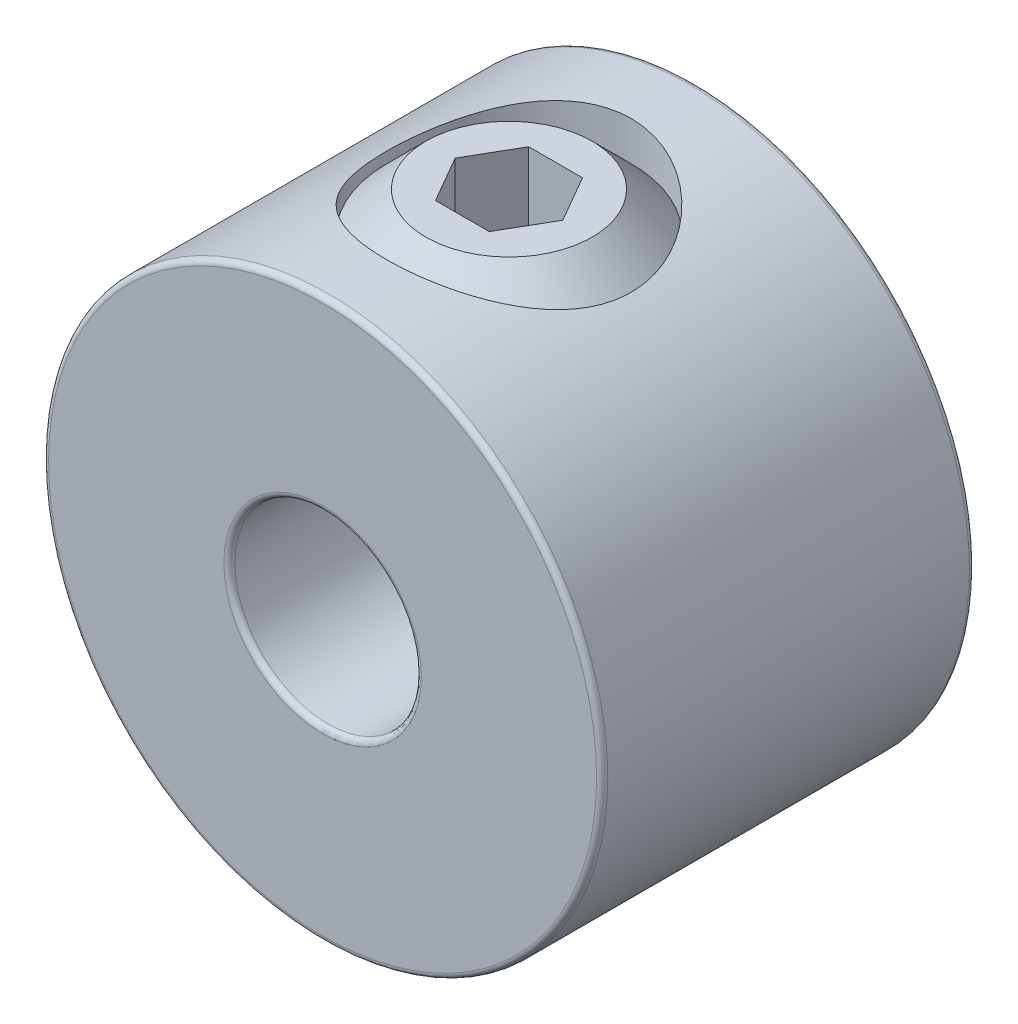
ISO-10303-21;
HEADER;
FILE_DESCRIPTION(('STEP AP214'),'2;1');
FILE_NAME('part.step','',(''),(''),'','','');
FILE_SCHEMA(('AUTOMOTIVE_DESIGN { 1 0 10303 214 1 1 1 1 }'));
ENDSEC;
DATA;
#1=APPLICATION_CONTEXT('core data for automotive mechanical design processes');
#2=APPLICATION_PROTOCOL_DEFINITION('international standard','automotive_design',2000,#1);
#3=PRODUCT_CONTEXT('',#1,'mechanical');
#4=PRODUCT('Part','Part','',(#3));
#5=PRODUCT_RELATED_PRODUCT_CATEGORY('part','',(#4));
#6=PRODUCT_DEFINITION_FORMATION('','',#4);
#7=PRODUCT_DEFINITION_CONTEXT('part definition',#1,'design');
#8=PRODUCT_DEFINITION('design','',#6,#7);
#9=PRODUCT_DEFINITION_SHAPE('','',#8);
#10=(LENGTH_UNIT() NAMED_UNIT(*) SI_UNIT(.MILLI.,.METRE.));
#11=(NAMED_UNIT(*) PLANE_ANGLE_UNIT() SI_UNIT($,.RADIAN.));
#12=(NAMED_UNIT(*) SI_UNIT($,.STERADIAN.) SOLID_ANGLE_UNIT());
#13=UNCERTAINTY_MEASURE_WITH_UNIT(LENGTH_MEASURE(1.E-05),#10,'distance_accuracy_value','');
#14=(GEOMETRIC_REPRESENTATION_CONTEXT(3) GLOBAL_UNCERTAINTY_ASSIGNED_CONTEXT((#13)) GLOBAL_UNIT_ASSIGNED_CONTEXT((#10,
#11,#12)) REPRESENTATION_CONTEXT('',''));
#15=CARTESIAN_POINT('',(0.,0.,0.));
#16=DIRECTION('',(0.,0.,1.));
#17=DIRECTION('',(1.,0.,0.));
#18=AXIS2_PLACEMENT_3D('',#15,#16,#17);
#19=CARTESIAN_POINT('',(0.,4.7625,0.));
#20=DIRECTION('',(0.,1.,0.));
#21=DIRECTION('',(-1.,0.,0.));
#22=AXIS2_PLACEMENT_3D('',#19,#20,#21);
#23=PLANE('',#22);
#24=CARTESIAN_POINT('',(0.,4.7625,0.));
#25=DIRECTION('',(0.,1.,0.));
#26=DIRECTION('',(-1.,0.,0.));
#27=AXIS2_PLACEMENT_3D('',#24,#25,#26);
#28=CIRCLE('',#27,1.41636774419345);
#29=CARTESIAN_POINT('',(-1.41636774419345,4.7625,0.));
#30=VERTEX_POINT('',#29);
#31=EDGE_CURVE('E12',#30,#30,#28,.T.);
#32=ORIENTED_EDGE('',*,*,#31,.T.);
#33=EDGE_LOOP('',(#32));
#34=FACE_BOUND('',#33,.T.);
#35=DIRECTION('',(1.,0.,0.));
#36=VECTOR('',#35,1.);
#37=CARTESIAN_POINT('',(-0.458271776169267,4.76249999999999,-0.793749999999997));
#38=LINE('',#37,#36);
#39=CARTESIAN_POINT('',(-0.458271776169267,4.76249999999999,-0.793749999999997));
#40=VERTEX_POINT('',#39);
#41=CARTESIAN_POINT('',(0.458271776169265,4.7625,-0.793749999999997));
#42=VERTEX_POINT('',#41);
#43=EDGE_CURVE('E115',#40,#42,#38,.T.);
#44=ORIENTED_EDGE('',*,*,#43,.T.);
#45=DIRECTION('',(0.5,0.,0.866025403784439));
#46=VECTOR('',#45,1.);
#47=CARTESIAN_POINT('',(0.458271776169265,4.76249999999999,-0.793749999999997));
#48=LINE('',#47,#46);
#49=CARTESIAN_POINT('',(0.91654355233853,4.76249999999999,0.));
#50=VERTEX_POINT('',#49);
#51=EDGE_CURVE('E61',#42,#50,#48,.T.);
#52=ORIENTED_EDGE('',*,*,#51,.T.);
#53=DIRECTION('',(-0.5,0.,0.866025403784439));
#54=VECTOR('',#53,1.);
#55=CARTESIAN_POINT('',(0.91654355233853,4.76249999999999,0.));
#56=LINE('',#55,#54);
#57=CARTESIAN_POINT('',(0.458271776169265,4.76249999999999,0.793750000000003));
#58=VERTEX_POINT('',#57);
#59=EDGE_CURVE('E119',#50,#58,#56,.T.);
#60=ORIENTED_EDGE('',*,*,#59,.T.);
#61=DIRECTION('',(-1.,0.,0.));
#62=VECTOR('',#61,1.);
#63=CARTESIAN_POINT('',(0.458271776169265,4.76249999999999,0.793750000000003));
#64=LINE('',#63,#62);
#65=CARTESIAN_POINT('',(-0.458271776169266,4.76249999999999,0.793750000000002));
#66=VERTEX_POINT('',#65);
#67=EDGE_CURVE('E182',#58,#66,#64,.T.);
#68=ORIENTED_EDGE('',*,*,#67,.T.);
#69=DIRECTION('',(-0.5,0.,-0.866025403784438));
#70=VECTOR('',#69,1.);
#71=CARTESIAN_POINT('',(-0.458271776169266,4.76249999999999,0.793750000000002));
#72=LINE('',#71,#70);
#73=CARTESIAN_POINT('',(-0.916543552338532,4.76249999999999,0.));
#74=VERTEX_POINT('',#73);
#75=EDGE_CURVE('E167',#66,#74,#72,.T.);
#76=ORIENTED_EDGE('',*,*,#75,.T.);
#77=DIRECTION('',(0.5,0.,-0.866025403784439));
#78=VECTOR('',#77,1.);
#79=CARTESIAN_POINT('',(-0.916543552338532,4.76249999999999,0.));
#80=LINE('',#79,#78);
#81=EDGE_CURVE('E163',#74,#40,#80,.T.);
#82=ORIENTED_EDGE('',*,*,#81,.T.);
#83=EDGE_LOOP('',(#44,#52,#60,#68,#76,#82));
#84=FACE_BOUND('',#83,.T.);
#85=ADVANCED_FACE('F47',(#34,#84),#23,.T.);
#86=CARTESIAN_POINT('',(0.,4.7625,0.));
#87=DIRECTION('',(0.,-1.,0.));
#88=DIRECTION('',(1.,0.,0.));
#89=AXIS2_PLACEMENT_3D('',#86,#87,#88);
#90=CONICAL_SURFACE('',#89,1.41636774419345,0.785398163397449);
#91=CARTESIAN_POINT('',(0.,4.09606774419345,0.));
#92=DIRECTION('',(0.,1.,0.));
#93=DIRECTION('',(-1.,0.,0.));
#94=AXIS2_PLACEMENT_3D('',#91,#92,#93);
#95=CIRCLE('',#94,2.0828);
#96=CARTESIAN_POINT('',(-2.0828,4.09606774419345,0.));
#97=VERTEX_POINT('',#96);
#98=EDGE_CURVE('E54',#97,#97,#95,.T.);
#99=ORIENTED_EDGE('',*,*,#98,.T.);
#100=EDGE_LOOP('',(#99));
#101=FACE_BOUND('',#100,.T.);
#102=ORIENTED_EDGE('',*,*,#31,.F.);
#103=EDGE_LOOP('',(#102));
#104=FACE_BOUND('',#103,.T.);
#105=ADVANCED_FACE('F137',(#101,#104),#90,.T.);
#106=CARTESIAN_POINT('',(0.,1.5875,0.));
#107=DIRECTION('',(0.,1.,0.));
#108=DIRECTION('',(-1.,0.,0.));
#109=AXIS2_PLACEMENT_3D('',#106,#107,#108);
#110=CYLINDRICAL_SURFACE('',#109,2.0828);
#111=CARTESIAN_POINT('',(0.,2.25393225580655,0.));
#112=DIRECTION('',(0.,1.,0.));
#113=DIRECTION('',(-1.,0.,0.));
#114=AXIS2_PLACEMENT_3D('',#111,#112,#113);
#115=CIRCLE('',#114,2.0828);
#116=CARTESIAN_POINT('',(-2.0828,2.25393225580655,0.));
#117=VERTEX_POINT('',#116);
#118=EDGE_CURVE('E132',#117,#117,#115,.T.);
#119=ORIENTED_EDGE('',*,*,#118,.T.);
#120=EDGE_LOOP('',(#119));
#121=FACE_BOUND('',#120,.T.);
#122=ORIENTED_EDGE('',*,*,#98,.F.);
#123=EDGE_LOOP('',(#122));
#124=FACE_BOUND('',#123,.T.);
#125=ADVANCED_FACE('F140',(#121,#124),#110,.T.);
#126=CARTESIAN_POINT('',(0.,2.25393225580655,0.));
#127=DIRECTION('',(0.,1.,0.));
#128=DIRECTION('',(-1.,0.,0.));
#129=AXIS2_PLACEMENT_3D('',#126,#127,#128);
#130=CONICAL_SURFACE('',#129,2.0828,0.785398163397448);
#131=CARTESIAN_POINT('',(0.,1.5875,0.));
#132=DIRECTION('',(0.,1.,0.));
#133=DIRECTION('',(-1.,0.,0.));
#134=AXIS2_PLACEMENT_3D('',#131,#132,#133);
#135=CIRCLE('',#134,1.41636774419345);
#136=CARTESIAN_POINT('',(-1.41636774419345,1.5875,0.));
#137=VERTEX_POINT('',#136);
#138=EDGE_CURVE('E124',#137,#137,#135,.T.);
#139=ORIENTED_EDGE('',*,*,#138,.T.);
#140=EDGE_LOOP('',(#139));
#141=FACE_BOUND('',#140,.T.);
#142=ORIENTED_EDGE('',*,*,#118,.F.);
#143=EDGE_LOOP('',(#142));
#144=FACE_BOUND('',#143,.T.);
#145=ADVANCED_FACE('F142',(#141,#144),#130,.T.);
#146=CARTESIAN_POINT('',(-1.41636774419345,1.5875,0.));
#147=DIRECTION('',(0.,-1.,0.));
#148=DIRECTION('',(1.,0.,0.));
#149=AXIS2_PLACEMENT_3D('',#146,#147,#148);
#150=PLANE('',#149);
#151=CARTESIAN_POINT('',(0.,1.5875,0.));
#152=DIRECTION('',(0.,1.,0.));
#153=DIRECTION('',(-1.,0.,0.));
#154=AXIS2_PLACEMENT_3D('',#151,#152,#153);
#155=CIRCLE('',#154,0.799718706967865);
#156=CARTESIAN_POINT('',(-0.799718706967865,1.5875,0.));
#157=VERTEX_POINT('',#156);
#158=EDGE_CURVE('E120',#157,#157,#155,.T.);
#159=ORIENTED_EDGE('',*,*,#158,.T.);
#160=EDGE_LOOP('',(#159));
#161=FACE_BOUND('',#160,.T.);
#162=ORIENTED_EDGE('',*,*,#138,.F.);
#163=EDGE_LOOP('',(#162));
#164=FACE_BOUND('',#163,.T.);
#165=ADVANCED_FACE('F149',(#161,#164),#150,.T.);
#166=CARTESIAN_POINT('',(0.,1.5875,0.));
#167=DIRECTION('',(0.,-1.,0.));
#168=DIRECTION('',(1.,0.,0.));
#169=AXIS2_PLACEMENT_3D('',#166,#167,#168);
#170=CONICAL_SURFACE('',#169,0.799718706967865,0.785398163397448);
#171=CARTESIAN_POINT('',(0.,2.38721870696786,0.));
#172=VERTEX_POINT('',#171);
#173=VERTEX_LOOP('',#172);
#174=FACE_BOUND('',#173,.T.);
#175=ORIENTED_EDGE('',*,*,#158,.F.);
#176=EDGE_LOOP('',(#175));
#177=FACE_BOUND('',#176,.T.);
#178=ADVANCED_FACE('F216',(#174,#177),#170,.F.);
#179=CARTESIAN_POINT('',(0.458271776169265,3.17499999999999,-0.793749999999997));
#180=DIRECTION('',(-0.866025403784439,0.,0.5));
#181=DIRECTION('',(0.5,0.,0.866025403784439));
#182=AXIS2_PLACEMENT_3D('',#179,#180,#181);
#183=PLANE('',#182);
#184=ORIENTED_EDGE('',*,*,#51,.F.);
#185=DIRECTION('',(0.,1.,0.));
#186=VECTOR('',#185,1.);
#187=CARTESIAN_POINT('',(0.458271776169265,3.17499999999999,-0.793749999999997));
#188=LINE('',#187,#186);
#189=CARTESIAN_POINT('',(0.458271776169265,3.17499999999999,-0.793749999999997));
#190=VERTEX_POINT('',#189);
#191=EDGE_CURVE('E114',#190,#42,#188,.T.);
#192=ORIENTED_EDGE('',*,*,#191,.F.);
#193=DIRECTION('',(0.5,0.,0.866025403784439));
#194=VECTOR('',#193,1.);
#195=CARTESIAN_POINT('',(0.458271776169265,3.17499999999999,-0.793749999999997));
#196=LINE('',#195,#194);
#197=CARTESIAN_POINT('',(0.91654355233853,3.17499999999999,0.));
#198=VERTEX_POINT('',#197);
#199=EDGE_CURVE('E105',#190,#198,#196,.T.);
#200=ORIENTED_EDGE('',*,*,#199,.T.);
#201=DIRECTION('',(0.,1.,0.));
#202=VECTOR('',#201,1.);
#203=CARTESIAN_POINT('',(0.91654355233853,3.17499999999999,0.));
#204=LINE('',#203,#202);
#205=EDGE_CURVE('E113',#198,#50,#204,.T.);
#206=ORIENTED_EDGE('',*,*,#205,.T.);
#207=EDGE_LOOP('',(#184,#192,#200,#206));
#208=FACE_BOUND('',#207,.T.);
#209=ADVANCED_FACE('F112',(#208),#183,.T.);
#210=CARTESIAN_POINT('',(0.91654355233853,3.17499999999999,0.));
#211=DIRECTION('',(-0.866025403784439,0.,-0.5));
#212=DIRECTION('',(-0.5,0.,0.866025403784439));
#213=AXIS2_PLACEMENT_3D('',#210,#211,#212);
#214=PLANE('',#213);
#215=ORIENTED_EDGE('',*,*,#59,.F.);
#216=ORIENTED_EDGE('',*,*,#205,.F.);
#217=DIRECTION('',(-0.5,0.,0.866025403784439));
#218=VECTOR('',#217,1.);
#219=CARTESIAN_POINT('',(0.91654355233853,3.17499999999999,0.));
#220=LINE('',#219,#218);
#221=CARTESIAN_POINT('',(0.458271776169265,3.17499999999999,0.793750000000003));
#222=VERTEX_POINT('',#221);
#223=EDGE_CURVE('E101',#198,#222,#220,.T.);
#224=ORIENTED_EDGE('',*,*,#223,.T.);
#225=DIRECTION('',(0.,1.,0.));
#226=VECTOR('',#225,1.);
#227=CARTESIAN_POINT('',(0.458271776169265,3.17499999999999,0.793750000000003));
#228=LINE('',#227,#226);
#229=EDGE_CURVE('E121',#222,#58,#228,.T.);
#230=ORIENTED_EDGE('',*,*,#229,.T.);
#231=EDGE_LOOP('',(#215,#216,#224,#230));
#232=FACE_BOUND('',#231,.T.);
#233=ADVANCED_FACE('F117',(#232),#214,.T.);
#234=CARTESIAN_POINT('',(0.458271776169265,3.17499999999999,0.793750000000003));
#235=DIRECTION('',(0.,0.,-1.));
#236=DIRECTION('',(-1.,0.,0.));
#237=AXIS2_PLACEMENT_3D('',#234,#235,#236);
#238=PLANE('',#237);
#239=ORIENTED_EDGE('',*,*,#67,.F.);
#240=ORIENTED_EDGE('',*,*,#229,.F.);
#241=DIRECTION('',(-1.,0.,0.));
#242=VECTOR('',#241,1.);
#243=CARTESIAN_POINT('',(0.458271776169265,3.17499999999999,0.793750000000003));
#244=LINE('',#243,#242);
#245=CARTESIAN_POINT('',(-0.458271776169266,3.17499999999999,0.793750000000002));
#246=VERTEX_POINT('',#245);
#247=EDGE_CURVE('E107',#222,#246,#244,.T.);
#248=ORIENTED_EDGE('',*,*,#247,.T.);
#249=DIRECTION('',(0.,1.,0.));
#250=VECTOR('',#249,1.);
#251=CARTESIAN_POINT('',(-0.458271776169266,3.17499999999999,0.793750000000002));
#252=LINE('',#251,#250);
#253=EDGE_CURVE('E126',#246,#66,#252,.T.);
#254=ORIENTED_EDGE('',*,*,#253,.T.);
#255=EDGE_LOOP('',(#239,#240,#248,#254));
#256=FACE_BOUND('',#255,.T.);
#257=ADVANCED_FACE('F180',(#256),#238,.T.);
#258=CARTESIAN_POINT('',(-0.458271776169266,3.17499999999999,0.793750000000002));
#259=DIRECTION('',(0.866025403784438,0.,-0.5));
#260=DIRECTION('',(-0.5,0.,-0.866025403784439));
#261=AXIS2_PLACEMENT_3D('',#258,#259,#260);
#262=PLANE('',#261);
#263=ORIENTED_EDGE('',*,*,#75,.F.);
#264=ORIENTED_EDGE('',*,*,#253,.F.);
#265=DIRECTION('',(-0.5,0.,-0.866025403784438));
#266=VECTOR('',#265,1.);
#267=CARTESIAN_POINT('',(-0.458271776169266,3.17499999999999,0.793750000000002));
#268=LINE('',#267,#266);
#269=CARTESIAN_POINT('',(-0.916543552338532,3.17499999999999,0.));
#270=VERTEX_POINT('',#269);
#271=EDGE_CURVE('E193',#246,#270,#268,.T.);
#272=ORIENTED_EDGE('',*,*,#271,.T.);
#273=DIRECTION('',(0.,1.,0.));
#274=VECTOR('',#273,1.);
#275=CARTESIAN_POINT('',(-0.916543552338532,3.17499999999999,0.));
#276=LINE('',#275,#274);
#277=EDGE_CURVE('E175',#270,#74,#276,.T.);
#278=ORIENTED_EDGE('',*,*,#277,.T.);
#279=EDGE_LOOP('',(#263,#264,#272,#278));
#280=FACE_BOUND('',#279,.T.);
#281=ADVANCED_FACE('F184',(#280),#262,.T.);
#282=CARTESIAN_POINT('',(-0.916543552338532,3.17499999999999,0.));
#283=DIRECTION('',(0.866025403784439,0.,0.5));
#284=DIRECTION('',(0.5,0.,-0.866025403784439));
#285=AXIS2_PLACEMENT_3D('',#282,#283,#284);
#286=PLANE('',#285);
#287=ORIENTED_EDGE('',*,*,#81,.F.);
#288=ORIENTED_EDGE('',*,*,#277,.F.);
#289=DIRECTION('',(0.5,0.,-0.866025403784439));
#290=VECTOR('',#289,1.);
#291=CARTESIAN_POINT('',(-0.916543552338532,3.17499999999999,0.));
#292=LINE('',#291,#290);
#293=CARTESIAN_POINT('',(-0.458271776169267,3.17499999999999,-0.793749999999997));
#294=VERTEX_POINT('',#293);
#295=EDGE_CURVE('E191',#270,#294,#292,.T.);
#296=ORIENTED_EDGE('',*,*,#295,.T.);
#297=DIRECTION('',(0.,1.,0.));
#298=VECTOR('',#297,1.);
#299=CARTESIAN_POINT('',(-0.458271776169267,3.17499999999999,-0.793749999999997));
#300=LINE('',#299,#298);
#301=EDGE_CURVE('E172',#294,#40,#300,.T.);
#302=ORIENTED_EDGE('',*,*,#301,.T.);
#303=EDGE_LOOP('',(#287,#288,#296,#302));
#304=FACE_BOUND('',#303,.T.);
#305=ADVANCED_FACE('F197',(#304),#286,.T.);
#306=CARTESIAN_POINT('',(-0.458271776169267,3.17499999999999,-0.793749999999997));
#307=DIRECTION('',(0.,0.,1.));
#308=DIRECTION('',(1.,0.,0.));
#309=AXIS2_PLACEMENT_3D('',#306,#307,#308);
#310=PLANE('',#309);
#311=ORIENTED_EDGE('',*,*,#43,.F.);
#312=ORIENTED_EDGE('',*,*,#301,.F.);
#313=DIRECTION('',(1.,0.,0.));
#314=VECTOR('',#313,1.);
#315=CARTESIAN_POINT('',(-0.458271776169267,3.17499999999999,-0.793749999999997));
#316=LINE('',#315,#314);
#317=EDGE_CURVE('E173',#294,#190,#316,.T.);
#318=ORIENTED_EDGE('',*,*,#317,.T.);
#319=ORIENTED_EDGE('',*,*,#191,.T.);
#320=EDGE_LOOP('',(#311,#312,#318,#319));
#321=FACE_BOUND('',#320,.T.);
#322=ADVANCED_FACE('F198',(#321),#310,.T.);
#323=CARTESIAN_POINT('',(0.,3.17499999999999,-1.5875));
#324=DIRECTION('',(0.,1.,0.));
#325=DIRECTION('',(0.,0.,1.));
#326=AXIS2_PLACEMENT_3D('',#323,#324,#325);
#327=PLANE('',#326);
#328=ORIENTED_EDGE('',*,*,#199,.F.);
#329=ORIENTED_EDGE('',*,*,#317,.F.);
#330=ORIENTED_EDGE('',*,*,#295,.F.);
#331=ORIENTED_EDGE('',*,*,#271,.F.);
#332=ORIENTED_EDGE('',*,*,#247,.F.);
#333=ORIENTED_EDGE('',*,*,#223,.F.);
#334=EDGE_LOOP('',(#328,#329,#330,#331,#332,#333));
#335=FACE_BOUND('',#334,.T.);
#336=ADVANCED_FACE('F103',(#335),#327,.T.);
#337=CLOSED_SHELL('',(#85,#105,#125,#145,#165,#178,#209,#233,#257,#281,#305,#322,#336));
#338=MANIFOLD_SOLID_BREP('B2',#337);
#339=CARTESIAN_POINT('',(0.,0.,3.175));
#340=DIRECTION('',(0.,0.,1.));
#341=DIRECTION('',(1.,0.,0.));
#342=AXIS2_PLACEMENT_3D('',#339,#340,#341);
#343=PLANE('',#342);
#344=CARTESIAN_POINT('',(0.,0.,3.175));
#345=DIRECTION('',(0.,0.,1.));
#346=DIRECTION('',(1.,0.,0.));
#347=AXIS2_PLACEMENT_3D('',#344,#345,#346);
#348=CIRCLE('',#347,1.68275);
#349=CARTESIAN_POINT('',(1.68275,0.,3.175));
#350=VERTEX_POINT('',#349);
#351=EDGE_CURVE('E404',#350,#350,#348,.F.);
#352=ORIENTED_EDGE('',*,*,#351,.T.);
#353=EDGE_LOOP('',(#352));
#354=FACE_BOUND('',#353,.T.);
#355=CARTESIAN_POINT('',(0.,0.,3.175));
#356=DIRECTION('',(0.,0.,1.));
#357=DIRECTION('',(1.,0.,0.));
#358=AXIS2_PLACEMENT_3D('',#355,#356,#357);
#359=CIRCLE('',#358,4.66725);
#360=CARTESIAN_POINT('',(4.66725,0.,3.175));
#361=VERTEX_POINT('',#360);
#362=EDGE_CURVE('E407',#361,#361,#359,.T.);
#363=ORIENTED_EDGE('',*,*,#362,.T.);
#364=EDGE_LOOP('',(#363));
#365=FACE_BOUND('',#364,.T.);
#366=ADVANCED_FACE('F302',(#354,#365),#343,.T.);
#367=CARTESIAN_POINT('',(0.,0.,-3.175));
#368=DIRECTION('',(0.,0.,1.));
#369=DIRECTION('',(1.,0.,0.));
#370=AXIS2_PLACEMENT_3D('',#367,#368,#369);
#371=PLANE('',#370);
#372=CARTESIAN_POINT('',(0.,0.,-3.175));
#373=DIRECTION('',(0.,0.,1.));
#374=DIRECTION('',(1.,0.,0.));
#375=AXIS2_PLACEMENT_3D('',#372,#373,#374);
#376=CIRCLE('',#375,1.68275);
#377=CARTESIAN_POINT('',(1.68275,0.,-3.175));
#378=VERTEX_POINT('',#377);
#379=EDGE_CURVE('E423',#378,#378,#376,.T.);
#380=ORIENTED_EDGE('',*,*,#379,.T.);
#381=EDGE_LOOP('',(#380));
#382=FACE_BOUND('',#381,.T.);
#383=CARTESIAN_POINT('',(0.,0.,-3.175));
#384=DIRECTION('',(0.,0.,1.));
#385=DIRECTION('',(1.,0.,0.));
#386=AXIS2_PLACEMENT_3D('',#383,#384,#385);
#387=CIRCLE('',#386,4.66725);
#388=CARTESIAN_POINT('',(4.66725,0.,-3.175));
#389=VERTEX_POINT('',#388);
#390=EDGE_CURVE('E426',#389,#389,#387,.F.);
#391=ORIENTED_EDGE('',*,*,#390,.T.);
#392=EDGE_LOOP('',(#391));
#393=FACE_BOUND('',#392,.T.);
#394=ADVANCED_FACE('F377',(#382,#393),#371,.F.);
#395=CARTESIAN_POINT('',(0.,0.,3.175));
#396=DIRECTION('',(0.,0.,-1.));
#397=DIRECTION('',(-1.,0.,0.));
#398=AXIS2_PLACEMENT_3D('',#395,#396,#397);
#399=CYLINDRICAL_SURFACE('',#398,4.7625);
#400=CARTESIAN_POINT('',(0.,0.,-3.07975));
#401=DIRECTION('',(0.,0.,1.));
#402=DIRECTION('',(1.,0.,0.));
#403=AXIS2_PLACEMENT_3D('',#400,#401,#402);
#404=CIRCLE('',#403,4.7625);
#405=CARTESIAN_POINT('',(4.7625,0.,-3.07975));
#406=VERTEX_POINT('',#405);
#407=EDGE_CURVE('E45',#406,#406,#404,.T.);
#408=ORIENTED_EDGE('',*,*,#407,.T.);
#409=EDGE_LOOP('',(#408));
#410=FACE_BOUND('',#409,.T.);
#411=CARTESIAN_POINT('',(0.,0.,3.07975));
#412=DIRECTION('',(0.,0.,1.));
#413=DIRECTION('',(1.,0.,0.));
#414=AXIS2_PLACEMENT_3D('',#411,#412,#413);
#415=CIRCLE('',#414,4.7625);
#416=CARTESIAN_POINT('',(4.7625,0.,3.07975));
#417=VERTEX_POINT('',#416);
#418=EDGE_CURVE('E310',#417,#417,#415,.F.);
#419=ORIENTED_EDGE('',*,*,#418,.T.);
#420=EDGE_LOOP('',(#419));
#421=FACE_BOUND('',#420,.T.);
#422=CARTESIAN_POINT('',(0.,4.7625,-2.0828));
#423=CARTESIAN_POINT('',(0.111071743653542,4.76249603683798,-2.08279511454019));
#424=CARTESIAN_POINT('',(0.222321981209684,4.75857075047714,-2.07386284884724));
#425=CARTESIAN_POINT('',(0.44163204752813,4.74326014196689,-2.03848302953371));
#426=CARTESIAN_POINT('',(0.549683347848137,4.73185647835827,-2.01199241060061));
#427=CARTESIAN_POINT('',(0.759075641824642,4.7028017052965,-1.94267235968527));
#428=CARTESIAN_POINT('',(0.860438815402187,4.68517262017172,-1.89990048656392));
#429=CARTESIAN_POINT('',(1.05444297980025,4.64536073563245,-1.79948474143014));
#430=CARTESIAN_POINT('',(1.14708611927771,4.6231790623039,-1.74184454620408));
#431=CARTESIAN_POINT('',(1.32619574297911,4.57511002512907,-1.61003985545174));
#432=CARTESIAN_POINT('',(1.41212894971673,4.54909352773982,-1.53519826357987));
#433=CARTESIAN_POINT('',(1.57069122617801,4.49681211039082,-1.37255123891813));
#434=CARTESIAN_POINT('',(1.64331261413432,4.47054705613312,-1.28473837332359));
#435=CARTESIAN_POINT('',(1.77718548713285,4.41910049192964,-1.0927508917876));
#436=CARTESIAN_POINT('',(1.83758288413799,4.39405989123975,-0.987938900088163));
#437=CARTESIAN_POINT('',(1.93965267630104,4.34997330262519,-0.76839674653208));
#438=CARTESIAN_POINT('',(1.98133567235285,4.33092392277086,-0.653672243714194));
#439=CARTESIAN_POINT('',(2.04253551397779,4.30238873246805,-0.423696863051076));
#440=CARTESIAN_POINT('',(2.06308358312361,4.29246082811126,-0.308777523916066));
#441=CARTESIAN_POINT('',(2.08463987832703,4.28203712029549,-0.0767266547426842));
#442=CARTESIAN_POINT('',(2.08566052842421,4.2815353196173,0.040403421252241));
#443=CARTESIAN_POINT('',(2.06890402974151,4.28965031049058,0.262769847892723));
#444=CARTESIAN_POINT('',(2.05273752581227,4.29748584669176,0.368162062558629));
#445=CARTESIAN_POINT('',(2.00478801183591,4.32006087723989,0.574552036914508));
#446=CARTESIAN_POINT('',(1.97300163554703,4.33480185974894,0.675548844239808));
#447=CARTESIAN_POINT('',(1.89408562418665,4.36986708620376,0.87295534667494));
#448=CARTESIAN_POINT('',(1.84663122587168,4.39030794585783,0.969213557296075));
#449=CARTESIAN_POINT('',(1.73795862832961,4.43444930703374,1.15279938929592));
#450=CARTESIAN_POINT('',(1.67673471928593,4.458151159207,1.24012328395491));
#451=CARTESIAN_POINT('',(1.5355152991307,4.50885047006117,1.41200269581225));
#452=CARTESIAN_POINT('',(1.45429620676035,4.53594828217284,1.49552632521228));
#453=CARTESIAN_POINT('',(1.27876496657885,4.58852439419557,1.64813395927907));
#454=CARTESIAN_POINT('',(1.18444911674085,4.61400223321385,1.71721386729299));
#455=CARTESIAN_POINT('',(0.98199315473799,4.66135005528445,1.84070142328266));
#456=CARTESIAN_POINT('',(0.873541867649991,4.68310019510073,1.89464833067304));
#457=CARTESIAN_POINT('',(0.647907883462879,4.71960237914975,1.98316213937343));
#458=CARTESIAN_POINT('',(0.530730563553071,4.73435869252319,2.01774086567294));
#459=CARTESIAN_POINT('',(0.29955813000625,4.75438789864071,2.06428227255898));
#460=CARTESIAN_POINT('',(0.185891496759438,4.76023920962634,2.07762721422875));
#461=CARTESIAN_POINT('',(-0.0422002334821483,4.76367688780338,2.08549375299993));
#462=CARTESIAN_POINT('',(-0.156625071558397,4.76126594457006,2.0800214755859));
#463=CARTESIAN_POINT('',(-0.376239500843618,4.74881910942428,2.05136058889142));
#464=CARTESIAN_POINT('',(-0.481587950692455,4.73921662092109,2.02917857508186));
#465=CARTESIAN_POINT('',(-0.686930546466433,4.71383524207829,1.96916956922145));
#466=CARTESIAN_POINT('',(-0.786924032776088,4.69805559282654,1.93134065479507));
#467=CARTESIAN_POINT('',(-0.982261063048847,4.66119752506809,1.83989504938421));
#468=CARTESIAN_POINT('',(-1.07736167728556,4.63996894204687,1.78582197069));
#469=CARTESIAN_POINT('',(-1.25748262320955,4.59443017780039,1.6639208402943));
#470=CARTESIAN_POINT('',(-1.34249857280958,4.57011866637559,1.59608684350934));
#471=CARTESIAN_POINT('',(-1.50704626884199,4.51865251251798,1.44239782605641));
#472=CARTESIAN_POINT('',(-1.58562810518119,4.4914242669029,1.35554792805158));
#473=CARTESIAN_POINT('',(-1.72740709734185,4.43882896395537,1.16953050819299));
#474=CARTESIAN_POINT('',(-1.7905993443691,4.41346250227109,1.07035907134913));
#475=CARTESIAN_POINT('',(-1.90090710616626,4.36710736891284,0.859669195288205));
#476=CARTESIAN_POINT('',(-1.94765867230782,4.34622137271274,0.747935873022526));
#477=CARTESIAN_POINT('',(-2.0212491556326,4.31249652288353,0.516972846718103));
#478=CARTESIAN_POINT('',(-2.04810675798185,4.29965011992725,0.397750291343308));
#479=CARTESIAN_POINT('',(-2.07920462806254,4.28469192309432,0.165832281285445));
#480=CARTESIAN_POINT('',(-2.08513454186304,4.28177887329684,0.0534145265093577));
#481=CARTESIAN_POINT('',(-2.07881197591436,4.28485257647482,-0.170771928973274));
#482=CARTESIAN_POINT('',(-2.06656305470401,4.29083758763964,-0.282540752409963));
#483=CARTESIAN_POINT('',(-2.02569515637557,4.31027001020765,-0.49571627082683));
#484=CARTESIAN_POINT('',(-1.99803909507488,4.323277191827,-0.597351771351678));
#485=CARTESIAN_POINT('',(-1.92813811730661,4.3548998918002,-0.794537542165885));
#486=CARTESIAN_POINT('',(-1.88588901568722,4.37351701883994,-0.89008605744196));
#487=CARTESIAN_POINT('',(-1.78494166316609,4.41571713998097,-1.07899211066855));
#488=CARTESIAN_POINT('',(-1.725372741989,4.43953957729138,-1.17182974435804));
#489=CARTESIAN_POINT('',(-1.59263020348555,4.48886909674828,-1.34671742038427));
#490=CARTESIAN_POINT('',(-1.5194511400755,4.51437685062871,-1.42876312182485));
#491=CARTESIAN_POINT('',(-1.35432770524478,4.56676110448629,-1.58681338482294));
#492=CARTESIAN_POINT('',(-1.26132618509931,4.59357384118389,-1.6617400539749));
#493=CARTESIAN_POINT('',(-1.06311311198694,4.6434498649562,-1.79502220381804));
#494=CARTESIAN_POINT('',(-0.957896042231122,4.66651144655632,-1.85337015589629));
#495=CARTESIAN_POINT('',(-0.739382134093289,4.70604817448379,-1.95076869953943));
#496=CARTESIAN_POINT('',(-0.626206683784868,4.72260425373065,-1.99005794004707));
#497=CARTESIAN_POINT('',(-0.394140312369526,4.74758674320463,-2.04864429899602));
#498=CARTESIAN_POINT('',(-0.275268139656886,4.75603812476299,-2.06800283944244));
#499=CARTESIAN_POINT('',(-0.129794269471647,4.76080263074086,-2.07891545879212));
#500=CARTESIAN_POINT('',(-0.103863601552121,4.76143809774343,-2.08037086112351));
#501=CARTESIAN_POINT('',(-0.0519585455601014,4.76228724785877,-2.08231370757314));
#502=CARTESIAN_POINT('',(-0.025984157092933,4.76250092714331,-2.08280114290593));
#503=CARTESIAN_POINT('',(0.,4.7625,-2.0828));
#504=B_SPLINE_CURVE_WITH_KNOTS('',3,(#422,#423,#424,#425,#426,#427,#428,#429,#430,#431,#432,
#433,#434,#435,#436,#437,#438,#439,#440,#441,#442,#443,#444,#445,#446,#447,#448,#449,#450,#451,
#452,#453,#454,#455,#456,#457,#458,#459,#460,#461,#462,#463,#464,#465,#466,#467,#468,#469,#470,
#471,#472,#473,#474,#475,#476,#477,#478,#479,#480,#481,#482,#483,#484,#485,#486,#487,#488,#489,
#490,#491,#492,#493,#494,#495,#496,#497,#498,#499,#500,#501,#502,#503),.UNSPECIFIED.,.T.,.F.,(4,
2,2,2,2,2,2,2,2,2,2,2,2,2,2,2,2,2,2,2,2,2,2,2,2,2,2,2,2,2,2,2,2,2,2,2,2,2,2,2,4),(0.,
0.33310820401824,0.667036459729852,0.999794986340983,1.33247130387411,1.68162667549892,
2.03098290203732,2.39971700590033,2.7682419735897,3.11778335773632,3.46710234380304,
3.78635020510975,4.10566689777941,4.43206803194443,4.75860476556179,5.11583708198563,
5.47317058268738,5.84042760868038,6.2074601656107,6.54944714283841,6.89132280512613,
7.21410342298589,7.5369237094021,7.86983121571278,8.2028828544175,8.56199956317258,
8.92123066925855,9.28797626701619,9.65437696508207,9.99041826400208,10.3263937909242,
10.6434074032701,10.9605120078414,11.2976529734516,11.6349291370471,12.000392010648,
12.3660205814544,12.7269444065746,13.0867525844208,13.16467931051,13.2426067438737),.UNSPECIFIED.);
#505=CARTESIAN_POINT('',(0.,4.7625,-2.0828));
#506=VERTEX_POINT('',#505);
#507=EDGE_CURVE('E336',#506,#506,#504,.T.);
#508=ORIENTED_EDGE('',*,*,#507,.T.);
#509=EDGE_LOOP('',(#508));
#510=FACE_BOUND('',#509,.T.);
#511=ADVANCED_FACE('F372',(#410,#421,#510),#399,.T.);
#512=CARTESIAN_POINT('',(0.,0.,3.175));
#513=DIRECTION('',(0.,0.,-1.));
#514=DIRECTION('',(-1.,0.,0.));
#515=AXIS2_PLACEMENT_3D('',#512,#513,#514);
#516=CYLINDRICAL_SURFACE('',#515,1.5875);
#517=CARTESIAN_POINT('',(0.,0.,-3.07975));
#518=DIRECTION('',(0.,0.,1.));
#519=DIRECTION('',(1.,0.,0.));
#520=AXIS2_PLACEMENT_3D('',#517,#518,#519);
#521=CIRCLE('',#520,1.5875);
#522=CARTESIAN_POINT('',(1.5875,0.,-3.07975));
#523=VERTEX_POINT('',#522);
#524=EDGE_CURVE('E409',#523,#523,#521,.F.);
#525=ORIENTED_EDGE('',*,*,#524,.T.);
#526=EDGE_LOOP('',(#525));
#527=FACE_BOUND('',#526,.T.);
#528=CARTESIAN_POINT('',(0.,0.,3.07975));
#529=DIRECTION('',(0.,0.,1.));
#530=DIRECTION('',(1.,0.,0.));
#531=AXIS2_PLACEMENT_3D('',#528,#529,#530);
#532=CIRCLE('',#531,1.5875);
#533=CARTESIAN_POINT('',(1.5875,0.,3.07975));
#534=VERTEX_POINT('',#533);
#535=EDGE_CURVE('E413',#534,#534,#532,.T.);
#536=ORIENTED_EDGE('',*,*,#535,.T.);
#537=EDGE_LOOP('',(#536));
#538=FACE_BOUND('',#537,.T.);
#539=DIRECTION('',(0.,0.,-1.));
#540=VECTOR('',#539,1.);
#541=CARTESIAN_POINT('',(-1.5875,0.,3.175));
#542=LINE('',#541,#540);
#543=CARTESIAN_POINT('',(-1.5875,0.,1.34829506785422));
#544=VERTEX_POINT('',#543);
#545=CARTESIAN_POINT('',(-1.5875,0.,-1.34829506785421));
#546=VERTEX_POINT('',#545);
#547=EDGE_CURVE('E323',#544,#546,#542,.T.);
#548=ORIENTED_EDGE('',*,*,#547,.F.);
#549=CARTESIAN_POINT('',(1.5875,0.,1.34829506785422));
#550=CARTESIAN_POINT('',(1.58751250167526,0.0371796749147055,1.34826321274444));
#551=CARTESIAN_POINT('',(1.58619448834938,0.0743368152597562,1.34983214466503));
#552=CARTESIAN_POINT('',(1.5810010783066,0.148143074735686,1.35592016207092));
#553=CARTESIAN_POINT('',(1.57713173107453,0.184793186717817,1.36043226870369));
#554=CARTESIAN_POINT('',(1.56701045178817,0.256789309024742,1.37207453397196));
#555=CARTESIAN_POINT('',(1.56079296373217,0.292146429453895,1.37916679256343));
#556=CARTESIAN_POINT('',(1.54611731101487,0.361866984859766,1.39560020965857));
#557=CARTESIAN_POINT('',(1.53765771843849,0.396229771057219,1.40494280097058));
#558=CARTESIAN_POINT('',(1.50503567667222,0.512154357741266,1.44016352212742));
#559=CARTESIAN_POINT('',(1.47571907048682,0.59093081639414,1.47058051988037));
#560=CARTESIAN_POINT('',(1.40626180974019,0.74128980345641,1.53714447955401));
#561=CARTESIAN_POINT('',(1.36605712251335,0.812826220569202,1.57332479990027));
#562=CARTESIAN_POINT('',(1.27471294209353,0.949831207604798,1.64825226441898));
#563=CARTESIAN_POINT('',(1.22334959214916,1.01512888617247,1.6870386570649));
#564=CARTESIAN_POINT('',(1.11072352096978,1.13724834257517,1.76322598026328));
#565=CARTESIAN_POINT('',(1.04947866931705,1.19408507090069,1.80062926467946));
#566=CARTESIAN_POINT('',(0.920098012279939,1.29617705938076,1.86992936668842));
#567=CARTESIAN_POINT('',(0.852356956311658,1.34181694576755,1.90199094223696));
#568=CARTESIAN_POINT('',(0.708642575009259,1.42294443446725,1.96006859265411));
#569=CARTESIAN_POINT('',(0.63267531733348,1.4584394502612,1.9860890794945));
#570=CARTESIAN_POINT('',(0.485776321743824,1.51306682465208,2.02657068395719));
#571=CARTESIAN_POINT('',(0.415776890074109,1.53384789297439,2.04217561064641));
#572=CARTESIAN_POINT('',(0.272406446490129,1.5656728294411,2.06618501990694));
#573=CARTESIAN_POINT('',(0.199037706908504,1.57672316160553,2.07459428237296));
#574=CARTESIAN_POINT('',(0.0507808964223539,1.58843334298424,2.08350793580315));
#575=CARTESIAN_POINT('',(-0.0241108013047271,1.58906450189512,2.08399049974052));
#576=CARTESIAN_POINT('',(-0.172861420881534,1.57981967780449,2.07694993537512));
#577=CARTESIAN_POINT('',(-0.246720175517261,1.56994201312079,2.06942552575051));
#578=CARTESIAN_POINT('',(-0.388279389604075,1.5409114047944,2.04749165662268));
#579=CARTESIAN_POINT('',(-0.456108145480459,1.52215233413765,2.03337488787617));
#580=CARTESIAN_POINT('',(-0.587406185721684,1.47646448752226,1.9994034600223));
#581=CARTESIAN_POINT('',(-0.650874396840001,1.44953370905982,1.97954739453806));
#582=CARTESIAN_POINT('',(-0.778997392705316,1.38527569071757,1.93296296376559));
#583=CARTESIAN_POINT('',(-0.843063822688289,1.34714863740529,1.90572902003637));
#584=CARTESIAN_POINT('',(-0.964120968561195,1.26335095857154,1.84744383799956));
#585=CARTESIAN_POINT('',(-1.02110696044344,1.21767534355788,1.81639007834271));
#586=CARTESIAN_POINT('',(-1.138346768057,1.10989755314037,1.7457911397389));
#587=CARTESIAN_POINT('',(-1.19698345673507,1.04633627240133,1.70578807059375));
#588=CARTESIAN_POINT('',(-1.30337353234163,0.910405907181486,1.62594395211023));
#589=CARTESIAN_POINT('',(-1.35111220101286,0.8380251114172,1.58610319242377));
#590=CARTESIAN_POINT('',(-1.42741004189136,0.698426743054093,1.51746534180557));
#591=CARTESIAN_POINT('',(-1.45787222459685,0.632598929333557,1.48796717045657));
#592=CARTESIAN_POINT('',(-1.50995014211112,0.495521491760589,1.43508838350889));
#593=CARTESIAN_POINT('',(-1.53161249138607,0.424302872288943,1.41167577579928));
#594=CARTESIAN_POINT('',(-1.56099054933736,0.294557807475359,1.37903370499662));
#595=CARTESIAN_POINT('',(-1.57079832030287,0.237043588970557,1.3677550011357));
#596=CARTESIAN_POINT('',(-1.58074899735265,0.149236681139509,1.35621282019037));
#597=CARTESIAN_POINT('',(-1.58327288134711,0.119547825026616,1.35326030204234));
#598=CARTESIAN_POINT('',(-1.58665131905841,0.0599112815862893,1.34929476943376));
#599=CARTESIAN_POINT('',(-1.58750384339394,0.0299633238939952,1.3482841128302));
#600=CARTESIAN_POINT('',(-1.5875,0.,1.34829506785422));
#601=B_SPLINE_CURVE_WITH_KNOTS('',3,(#549,#550,#551,#552,#553,#554,#555,#556,#557,#558,#559,
#560,#561,#562,#563,#564,#565,#566,#567,#568,#569,#570,#571,#572,#573,#574,#575,#576,#577,#578,
#579,#580,#581,#582,#583,#584,#585,#586,#587,#588,#589,#590,#591,#592,#593,#594,#595,#596,#597,
#598,#599,#600),.UNSPECIFIED.,.F.,.F.,(4,2,2,2,2,2,2,2,2,2,2,2,2,2,2,2,2,2,2,2,2,2,2,2,2,4),(0.,
0.111446436260419,0.222629566829427,0.332241432902638,0.441923275245671,0.708474779801608,
0.976629253003099,1.25076368732977,1.52440782517585,1.78662051715592,2.0486411013861,
2.27167947822604,2.49456958113516,2.71807333362329,2.94161285784332,3.1560541708532,
3.37054807590767,3.60779585858109,3.84520109051919,4.1299808725199,4.41514301634629,
4.64933235125087,4.88226443370479,5.05977123890358,5.14949546424099,5.23932856630523),.UNSPECIFIED.);
#602=CARTESIAN_POINT('',(1.5875,0.,1.34829506785422));
#603=VERTEX_POINT('',#602);
#604=EDGE_CURVE('E335',#603,#544,#601,.T.);
#605=ORIENTED_EDGE('',*,*,#604,.F.);
#606=DIRECTION('',(0.,0.,-1.));
#607=VECTOR('',#606,1.);
#608=CARTESIAN_POINT('',(1.5875,0.,3.175));
#609=LINE('',#608,#607);
#610=CARTESIAN_POINT('',(1.5875,0.,-1.34829506785421));
#611=VERTEX_POINT('',#610);
#612=EDGE_CURVE('E330',#611,#603,#609,.F.);
#613=ORIENTED_EDGE('',*,*,#612,.F.);
#614=CARTESIAN_POINT('',(-1.5875,0.,-1.34829506785421));
#615=CARTESIAN_POINT('',(-1.58751250167526,0.0371796749147055,-1.34826321274443));
#616=CARTESIAN_POINT('',(-1.58619448834938,0.0743368152597562,-1.34983214466503));
#617=CARTESIAN_POINT('',(-1.5810010783066,0.148143074735686,-1.35592016207092));
#618=CARTESIAN_POINT('',(-1.57713173107453,0.184793186717817,-1.36043226870368));
#619=CARTESIAN_POINT('',(-1.56701045178817,0.256789309024742,-1.37207453397196));
#620=CARTESIAN_POINT('',(-1.56079296373217,0.292146429453895,-1.37916679256342));
#621=CARTESIAN_POINT('',(-1.54611731101487,0.361866984859766,-1.39560020965856));
#622=CARTESIAN_POINT('',(-1.53765771843849,0.396229771057219,-1.40494280097057));
#623=CARTESIAN_POINT('',(-1.50503567667222,0.512154357741266,-1.44016352212741));
#624=CARTESIAN_POINT('',(-1.47571907048682,0.59093081639414,-1.47058051988036));
#625=CARTESIAN_POINT('',(-1.40626180974019,0.74128980345641,-1.53714447955401));
#626=CARTESIAN_POINT('',(-1.36605712251335,0.812826220569202,-1.57332479990027));
#627=CARTESIAN_POINT('',(-1.27471294209353,0.949831207604799,-1.64825226441897));
#628=CARTESIAN_POINT('',(-1.22334959214916,1.01512888617247,-1.68703865706489));
#629=CARTESIAN_POINT('',(-1.11072352096978,1.13724834257517,-1.76322598026328));
#630=CARTESIAN_POINT('',(-1.04947866931705,1.19408507090069,-1.80062926467945));
#631=CARTESIAN_POINT('',(-0.920098012279939,1.29617705938076,-1.86992936668842));
#632=CARTESIAN_POINT('',(-0.852356956311657,1.34181694576755,-1.90199094223695));
#633=CARTESIAN_POINT('',(-0.708642575009259,1.42294443446725,-1.9600685926541));
#634=CARTESIAN_POINT('',(-0.63267531733348,1.4584394502612,-1.98608907949449));
#635=CARTESIAN_POINT('',(-0.485776321743824,1.51306682465208,-2.02657068395718));
#636=CARTESIAN_POINT('',(-0.415776890074109,1.53384789297439,-2.04217561064641));
#637=CARTESIAN_POINT('',(-0.272406446490129,1.5656728294411,-2.06618501990694));
#638=CARTESIAN_POINT('',(-0.199037706908504,1.57672316160553,-2.07459428237295));
#639=CARTESIAN_POINT('',(-0.0507808964223539,1.58843334298424,-2.08350793580315));
#640=CARTESIAN_POINT('',(0.0241108013047271,1.58906450189512,-2.08399049974051));
#641=CARTESIAN_POINT('',(0.172861420881534,1.57981967780449,-2.07694993537511));
#642=CARTESIAN_POINT('',(0.246720175517261,1.56994201312079,-2.06942552575051));
#643=CARTESIAN_POINT('',(0.388279389604075,1.5409114047944,-2.04749165662267));
#644=CARTESIAN_POINT('',(0.456108145480459,1.52215233413765,-2.03337488787616));
#645=CARTESIAN_POINT('',(0.587406185721684,1.47646448752226,-1.99940346002229));
#646=CARTESIAN_POINT('',(0.650874396840001,1.44953370905982,-1.97954739453805));
#647=CARTESIAN_POINT('',(0.778997392705316,1.38527569071757,-1.93296296376558));
#648=CARTESIAN_POINT('',(0.843063822688289,1.34714863740529,-1.90572902003636));
#649=CARTESIAN_POINT('',(0.964120968561195,1.26335095857154,-1.84744383799955));
#650=CARTESIAN_POINT('',(1.02110696044344,1.21767534355788,-1.8163900783427));
#651=CARTESIAN_POINT('',(1.138346768057,1.10989755314037,-1.74579113973889));
#652=CARTESIAN_POINT('',(1.19698345673507,1.04633627240133,-1.70578807059375));
#653=CARTESIAN_POINT('',(1.30337353234163,0.910405907181486,-1.62594395211022));
#654=CARTESIAN_POINT('',(1.35111220101286,0.8380251114172,-1.58610319242376));
#655=CARTESIAN_POINT('',(1.42741004189136,0.698426743054093,-1.51746534180557));
#656=CARTESIAN_POINT('',(1.45787222459685,0.632598929333557,-1.48796717045657));
#657=CARTESIAN_POINT('',(1.50995014211112,0.495521491760589,-1.43508838350888));
#658=CARTESIAN_POINT('',(1.53161249138607,0.424302872288943,-1.41167577579927));
#659=CARTESIAN_POINT('',(1.56099054933736,0.294557807475359,-1.37903370499662));
#660=CARTESIAN_POINT('',(1.57079832030287,0.237043588970557,-1.36775500113569));
#661=CARTESIAN_POINT('',(1.58074899735265,0.149236681139509,-1.35621282019036));
#662=CARTESIAN_POINT('',(1.58327288134711,0.119547825026616,-1.35326030204234));
#663=CARTESIAN_POINT('',(1.58665131905841,0.0599112815862893,-1.34929476943376));
#664=CARTESIAN_POINT('',(1.58750384339394,0.0299633238939952,-1.3482841128302));
#665=CARTESIAN_POINT('',(1.5875,0.,-1.34829506785422));
#666=B_SPLINE_CURVE_WITH_KNOTS('',3,(#614,#615,#616,#617,#618,#619,#620,#621,#622,#623,#624,
#625,#626,#627,#628,#629,#630,#631,#632,#633,#634,#635,#636,#637,#638,#639,#640,#641,#642,#643,
#644,#645,#646,#647,#648,#649,#650,#651,#652,#653,#654,#655,#656,#657,#658,#659,#660,#661,#662,
#663,#664,#665),.UNSPECIFIED.,.F.,.F.,(4,2,2,2,2,2,2,2,2,2,2,2,2,2,2,2,2,2,2,2,2,2,2,2,2,4),(0.,
0.111446436260419,0.222629566829427,0.332241432902638,0.441923275245671,0.708474779801608,
0.976629253003099,1.25076368732977,1.52440782517585,1.78662051715592,2.0486411013861,
2.27167947822604,2.49456958113516,2.71807333362329,2.94161285784332,3.1560541708532,
3.37054807590767,3.60779585858109,3.84520109051919,4.1299808725199,4.41514301634629,
4.64933235125087,4.88226443370479,5.05977123890358,5.14949546424099,5.23932856630523),.UNSPECIFIED.);
#667=EDGE_CURVE('E341',#546,#611,#666,.T.);
#668=ORIENTED_EDGE('',*,*,#667,.F.);
#669=EDGE_LOOP('',(#548,#605,#613,#668));
#670=FACE_BOUND('',#669,.T.);
#671=ADVANCED_FACE('F344',(#527,#538,#670),#516,.F.);
#672=CARTESIAN_POINT('',(0.,4.7625,0.));
#673=DIRECTION('',(0.,-1.,0.));
#674=DIRECTION('',(0.,0.,-1.));
#675=AXIS2_PLACEMENT_3D('',#672,#673,#674);
#676=CYLINDRICAL_SURFACE('',#675,2.0828);
#677=ORIENTED_EDGE('',*,*,#667,.T.);
#678=CARTESIAN_POINT('',(0.,0.,0.));
#679=DIRECTION('',(0.,-1.,0.));
#680=DIRECTION('',(0.,0.,-1.));
#681=AXIS2_PLACEMENT_3D('',#678,#679,#680);
#682=CIRCLE('',#681,2.0828);
#683=EDGE_CURVE('E316',#611,#603,#682,.T.);
#684=ORIENTED_EDGE('',*,*,#683,.T.);
#685=ORIENTED_EDGE('',*,*,#604,.T.);
#686=EDGE_CURVE('E342',#544,#546,#682,.T.);
#687=ORIENTED_EDGE('',*,*,#686,.T.);
#688=EDGE_LOOP('',(#677,#684,#685,#687));
#689=FACE_BOUND('',#688,.T.);
#690=ORIENTED_EDGE('',*,*,#507,.F.);
#691=EDGE_LOOP('',(#690));
#692=FACE_BOUND('',#691,.T.);
#693=ADVANCED_FACE('F339',(#689,#692),#676,.F.);
#694=CARTESIAN_POINT('',(0.,0.,0.));
#695=DIRECTION('',(0.,-1.,0.));
#696=DIRECTION('',(0.,0.,-1.));
#697=AXIS2_PLACEMENT_3D('',#694,#695,#696);
#698=PLANE('',#697);
#699=ORIENTED_EDGE('',*,*,#547,.T.);
#700=ORIENTED_EDGE('',*,*,#686,.F.);
#701=EDGE_LOOP('',(#699,#700));
#702=FACE_BOUND('',#701,.T.);
#703=ADVANCED_FACE('F364',(#702),#698,.F.);
#704=ORIENTED_EDGE('',*,*,#612,.T.);
#705=ORIENTED_EDGE('',*,*,#683,.F.);
#706=EDGE_LOOP('',(#704,#705));
#707=FACE_BOUND('',#706,.T.);
#708=ADVANCED_FACE('F331',(#707),#698,.F.);
#709=CARTESIAN_POINT('',(0.,0.,-3.07975));
#710=DIRECTION('',(0.,0.,1.));
#711=DIRECTION('',(1.,0.,0.));
#712=AXIS2_PLACEMENT_3D('',#709,#710,#711);
#713=TOROIDAL_SURFACE('',#712,1.68275,0.09525);
#714=ORIENTED_EDGE('',*,*,#524,.F.);
#715=EDGE_LOOP('',(#714));
#716=FACE_BOUND('',#715,.T.);
#717=ORIENTED_EDGE('',*,*,#379,.F.);
#718=EDGE_LOOP('',(#717));
#719=FACE_BOUND('',#718,.T.);
#720=ADVANCED_FACE('F379',(#716,#719),#713,.T.);
#721=CARTESIAN_POINT('',(0.,0.,3.07975));
#722=DIRECTION('',(0.,0.,1.));
#723=DIRECTION('',(1.,0.,0.));
#724=AXIS2_PLACEMENT_3D('',#721,#722,#723);
#725=TOROIDAL_SURFACE('',#724,1.68275,0.09525);
#726=ORIENTED_EDGE('',*,*,#351,.F.);
#727=EDGE_LOOP('',(#726));
#728=FACE_BOUND('',#727,.T.);
#729=ORIENTED_EDGE('',*,*,#535,.F.);
#730=EDGE_LOOP('',(#729));
#731=FACE_BOUND('',#730,.T.);
#732=ADVANCED_FACE('F382',(#728,#731),#725,.T.);
#733=CARTESIAN_POINT('',(0.,0.,-3.07975));
#734=DIRECTION('',(0.,0.,1.));
#735=DIRECTION('',(1.,0.,0.));
#736=AXIS2_PLACEMENT_3D('',#733,#734,#735);
#737=TOROIDAL_SURFACE('',#736,4.66725,0.09525);
#738=ORIENTED_EDGE('',*,*,#390,.F.);
#739=EDGE_LOOP('',(#738));
#740=FACE_BOUND('',#739,.T.);
#741=ORIENTED_EDGE('',*,*,#407,.F.);
#742=EDGE_LOOP('',(#741));
#743=FACE_BOUND('',#742,.T.);
#744=ADVANCED_FACE('F385',(#740,#743),#737,.T.);
#745=CARTESIAN_POINT('',(0.,0.,3.07975));
#746=DIRECTION('',(0.,0.,1.));
#747=DIRECTION('',(1.,0.,0.));
#748=AXIS2_PLACEMENT_3D('',#745,#746,#747);
#749=TOROIDAL_SURFACE('',#748,4.66725,0.09525);
#750=ORIENTED_EDGE('',*,*,#418,.F.);
#751=EDGE_LOOP('',(#750));
#752=FACE_BOUND('',#751,.T.);
#753=ORIENTED_EDGE('',*,*,#362,.F.);
#754=EDGE_LOOP('',(#753));
#755=FACE_BOUND('',#754,.T.);
#756=ADVANCED_FACE('F304',(#752,#755),#749,.T.);
#757=CLOSED_SHELL('',(#366,#394,#511,#671,#693,#703,#708,#720,#732,#744,#756));
#758=MANIFOLD_SOLID_BREP('B6',#757);
#759=ADVANCED_BREP_SHAPE_REPRESENTATION('',(#18,#338,#758),#14);
#760=SHAPE_DEFINITION_REPRESENTATION(#9,#759);
ENDSEC;
END-ISO-10303-21;
